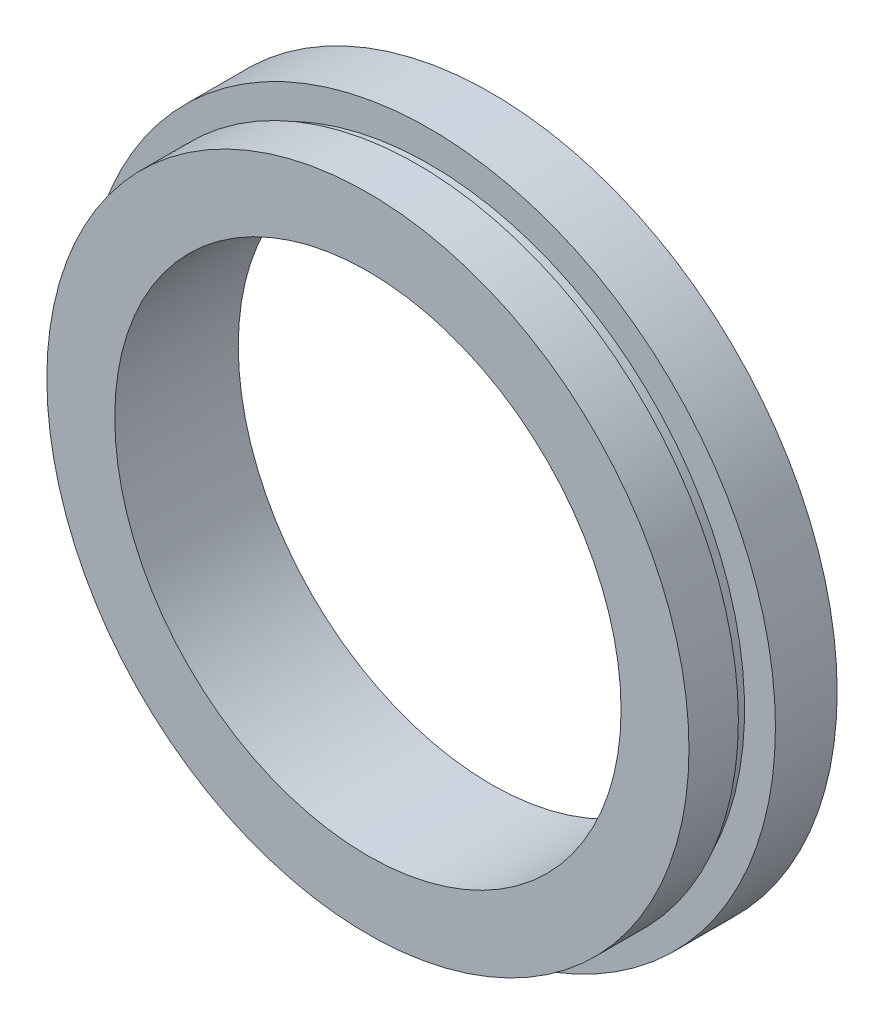
ISO-10303-21;
HEADER;
FILE_DESCRIPTION(('STEP AP214'),'2;1');
FILE_NAME('part.step','',(''),(''),'','','');
FILE_SCHEMA(('AUTOMOTIVE_DESIGN { 1 0 10303 214 1 1 1 1 }'));
ENDSEC;
DATA;
#1=APPLICATION_CONTEXT('core data for automotive mechanical design processes');
#2=APPLICATION_PROTOCOL_DEFINITION('international standard','automotive_design',2000,#1);
#3=PRODUCT_CONTEXT('',#1,'mechanical');
#4=PRODUCT('Part','Part','',(#3));
#5=PRODUCT_RELATED_PRODUCT_CATEGORY('part','',(#4));
#6=PRODUCT_DEFINITION_FORMATION('','',#4);
#7=PRODUCT_DEFINITION_CONTEXT('part definition',#1,'design');
#8=PRODUCT_DEFINITION('design','',#6,#7);
#9=PRODUCT_DEFINITION_SHAPE('','',#8);
#10=(LENGTH_UNIT() NAMED_UNIT(*) SI_UNIT(.MILLI.,.METRE.));
#11=(NAMED_UNIT(*) PLANE_ANGLE_UNIT() SI_UNIT($,.RADIAN.));
#12=(NAMED_UNIT(*) SI_UNIT($,.STERADIAN.) SOLID_ANGLE_UNIT());
#13=UNCERTAINTY_MEASURE_WITH_UNIT(LENGTH_MEASURE(1.E-05),#10,'distance_accuracy_value','');
#14=(GEOMETRIC_REPRESENTATION_CONTEXT(3) GLOBAL_UNCERTAINTY_ASSIGNED_CONTEXT((#13)) GLOBAL_UNIT_ASSIGNED_CONTEXT((#10,
#11,#12)) REPRESENTATION_CONTEXT('',''));
#15=CARTESIAN_POINT('',(0.,0.,0.));
#16=DIRECTION('',(0.,0.,1.));
#17=DIRECTION('',(1.,0.,0.));
#18=AXIS2_PLACEMENT_3D('',#15,#16,#17);
#19=CARTESIAN_POINT('',(20.5,0.,0.));
#20=DIRECTION('',(0.,0.,-1.));
#21=DIRECTION('',(-1.,0.,0.));
#22=AXIS2_PLACEMENT_3D('',#19,#20,#21);
#23=PLANE('',#22);
#24=CARTESIAN_POINT('',(0.,0.,0.));
#25=DIRECTION('',(0.,0.,-1.));
#26=DIRECTION('',(-1.,0.,0.));
#27=AXIS2_PLACEMENT_3D('',#24,#25,#26);
#28=CIRCLE('',#27,26.);
#29=CARTESIAN_POINT('',(-26.,0.,0.));
#30=VERTEX_POINT('',#29);
#31=EDGE_CURVE('E10',#30,#30,#28,.T.);
#32=ORIENTED_EDGE('',*,*,#31,.F.);
#33=EDGE_LOOP('',(#32));
#34=FACE_BOUND('',#33,.T.);
#35=CARTESIAN_POINT('',(0.,0.,0.));
#36=DIRECTION('',(0.,0.,-1.));
#37=DIRECTION('',(-1.,0.,0.));
#38=AXIS2_PLACEMENT_3D('',#35,#36,#37);
#39=CIRCLE('',#38,20.5);
#40=CARTESIAN_POINT('',(-20.5,0.,0.));
#41=VERTEX_POINT('',#40);
#42=EDGE_CURVE('E63',#41,#41,#39,.T.);
#43=ORIENTED_EDGE('',*,*,#42,.T.);
#44=EDGE_LOOP('',(#43));
#45=FACE_BOUND('',#44,.T.);
#46=ADVANCED_FACE('F35',(#34,#45),#23,.F.);
#47=CARTESIAN_POINT('',(0.,0.,-19.1405797101449));
#48=DIRECTION('',(0.,0.,-1.));
#49=DIRECTION('',(-1.,0.,0.));
#50=AXIS2_PLACEMENT_3D('',#47,#48,#49);
#51=CYLINDRICAL_SURFACE('',#50,26.);
#52=CARTESIAN_POINT('',(0.,0.,-4.));
#53=DIRECTION('',(0.,0.,-1.));
#54=DIRECTION('',(-1.,0.,0.));
#55=AXIS2_PLACEMENT_3D('',#52,#53,#54);
#56=CIRCLE('',#55,26.);
#57=CARTESIAN_POINT('',(-26.,0.,-4.));
#58=VERTEX_POINT('',#57);
#59=EDGE_CURVE('E41',#58,#58,#56,.T.);
#60=ORIENTED_EDGE('',*,*,#59,.F.);
#61=EDGE_LOOP('',(#60));
#62=FACE_BOUND('',#61,.T.);
#63=ORIENTED_EDGE('',*,*,#31,.T.);
#64=EDGE_LOOP('',(#63));
#65=FACE_BOUND('',#64,.T.);
#66=ADVANCED_FACE('F100',(#62,#65),#51,.T.);
#67=CARTESIAN_POINT('',(26.,0.,-4.));
#68=DIRECTION('',(0.,0.,1.));
#69=DIRECTION('',(1.,0.,0.));
#70=AXIS2_PLACEMENT_3D('',#67,#68,#69);
#71=PLANE('',#70);
#72=CARTESIAN_POINT('',(0.,0.,-4.));
#73=DIRECTION('',(0.,0.,-1.));
#74=DIRECTION('',(-1.,0.,0.));
#75=AXIS2_PLACEMENT_3D('',#72,#73,#74);
#76=CIRCLE('',#75,25.5);
#77=CARTESIAN_POINT('',(-25.5,0.,-4.));
#78=VERTEX_POINT('',#77);
#79=EDGE_CURVE('E45',#78,#78,#76,.T.);
#80=ORIENTED_EDGE('',*,*,#79,.F.);
#81=EDGE_LOOP('',(#80));
#82=FACE_BOUND('',#81,.T.);
#83=ORIENTED_EDGE('',*,*,#59,.T.);
#84=EDGE_LOOP('',(#83));
#85=FACE_BOUND('',#84,.T.);
#86=ADVANCED_FACE('F95',(#82,#85),#71,.F.);
#87=CARTESIAN_POINT('',(0.,0.,-19.1405797101449));
#88=DIRECTION('',(0.,0.,-1.));
#89=DIRECTION('',(-1.,0.,0.));
#90=AXIS2_PLACEMENT_3D('',#87,#88,#89);
#91=CYLINDRICAL_SURFACE('',#90,25.5);
#92=CARTESIAN_POINT('',(0.,0.,-5.));
#93=DIRECTION('',(0.,0.,-1.));
#94=DIRECTION('',(-1.,0.,0.));
#95=AXIS2_PLACEMENT_3D('',#92,#93,#94);
#96=CIRCLE('',#95,25.5);
#97=CARTESIAN_POINT('',(-25.5,0.,-5.));
#98=VERTEX_POINT('',#97);
#99=EDGE_CURVE('E49',#98,#98,#96,.T.);
#100=ORIENTED_EDGE('',*,*,#99,.F.);
#101=EDGE_LOOP('',(#100));
#102=FACE_BOUND('',#101,.T.);
#103=ORIENTED_EDGE('',*,*,#79,.T.);
#104=EDGE_LOOP('',(#103));
#105=FACE_BOUND('',#104,.T.);
#106=ADVANCED_FACE('F89',(#102,#105),#91,.T.);
#107=CARTESIAN_POINT('',(25.5,0.,-5.));
#108=DIRECTION('',(0.,0.,-1.));
#109=DIRECTION('',(-1.,0.,0.));
#110=AXIS2_PLACEMENT_3D('',#107,#108,#109);
#111=PLANE('',#110);
#112=CARTESIAN_POINT('',(0.,0.,-5.));
#113=DIRECTION('',(0.,0.,-1.));
#114=DIRECTION('',(-1.,0.,0.));
#115=AXIS2_PLACEMENT_3D('',#112,#113,#114);
#116=CIRCLE('',#115,28.);
#117=CARTESIAN_POINT('',(-28.,0.,-5.));
#118=VERTEX_POINT('',#117);
#119=EDGE_CURVE('E54',#118,#118,#116,.T.);
#120=ORIENTED_EDGE('',*,*,#119,.F.);
#121=EDGE_LOOP('',(#120));
#122=FACE_BOUND('',#121,.T.);
#123=ORIENTED_EDGE('',*,*,#99,.T.);
#124=EDGE_LOOP('',(#123));
#125=FACE_BOUND('',#124,.T.);
#126=ADVANCED_FACE('F83',(#122,#125),#111,.F.);
#127=CARTESIAN_POINT('',(0.,0.,-19.1405797101449));
#128=DIRECTION('',(0.,0.,-1.));
#129=DIRECTION('',(-1.,0.,0.));
#130=AXIS2_PLACEMENT_3D('',#127,#128,#129);
#131=CYLINDRICAL_SURFACE('',#130,28.);
#132=CARTESIAN_POINT('',(0.,0.,-10.));
#133=DIRECTION('',(0.,0.,-1.));
#134=DIRECTION('',(-1.,0.,0.));
#135=AXIS2_PLACEMENT_3D('',#132,#133,#134);
#136=CIRCLE('',#135,28.);
#137=CARTESIAN_POINT('',(-28.,0.,-10.));
#138=VERTEX_POINT('',#137);
#139=EDGE_CURVE('E57',#138,#138,#136,.T.);
#140=ORIENTED_EDGE('',*,*,#139,.F.);
#141=EDGE_LOOP('',(#140));
#142=FACE_BOUND('',#141,.T.);
#143=ORIENTED_EDGE('',*,*,#119,.T.);
#144=EDGE_LOOP('',(#143));
#145=FACE_BOUND('',#144,.T.);
#146=ADVANCED_FACE('F77',(#142,#145),#131,.T.);
#147=CARTESIAN_POINT('',(28.,0.,-10.));
#148=DIRECTION('',(0.,0.,1.));
#149=DIRECTION('',(1.,0.,0.));
#150=AXIS2_PLACEMENT_3D('',#147,#148,#149);
#151=PLANE('',#150);
#152=CARTESIAN_POINT('',(0.,0.,-10.));
#153=DIRECTION('',(0.,0.,-1.));
#154=DIRECTION('',(-1.,0.,0.));
#155=AXIS2_PLACEMENT_3D('',#152,#153,#154);
#156=CIRCLE('',#155,20.5);
#157=CARTESIAN_POINT('',(-20.5,0.,-10.));
#158=VERTEX_POINT('',#157);
#159=EDGE_CURVE('E60',#158,#158,#156,.T.);
#160=ORIENTED_EDGE('',*,*,#159,.F.);
#161=EDGE_LOOP('',(#160));
#162=FACE_BOUND('',#161,.T.);
#163=ORIENTED_EDGE('',*,*,#139,.T.);
#164=EDGE_LOOP('',(#163));
#165=FACE_BOUND('',#164,.T.);
#166=ADVANCED_FACE('F71',(#162,#165),#151,.F.);
#167=CARTESIAN_POINT('',(0.,0.,-19.1405797101449));
#168=DIRECTION('',(0.,0.,-1.));
#169=DIRECTION('',(-1.,0.,0.));
#170=AXIS2_PLACEMENT_3D('',#167,#168,#169);
#171=CYLINDRICAL_SURFACE('',#170,20.5);
#172=ORIENTED_EDGE('',*,*,#42,.F.);
#173=EDGE_LOOP('',(#172));
#174=FACE_BOUND('',#173,.T.);
#175=ORIENTED_EDGE('',*,*,#159,.T.);
#176=EDGE_LOOP('',(#175));
#177=FACE_BOUND('',#176,.T.);
#178=ADVANCED_FACE('F68',(#174,#177),#171,.F.);
#179=CLOSED_SHELL('',(#46,#66,#86,#106,#126,#146,#166,#178));
#180=MANIFOLD_SOLID_BREP('B2',#179);
#181=ADVANCED_BREP_SHAPE_REPRESENTATION('',(#18,#180),#14);
#182=SHAPE_DEFINITION_REPRESENTATION(#9,#181);
ENDSEC;
END-ISO-10303-21;
